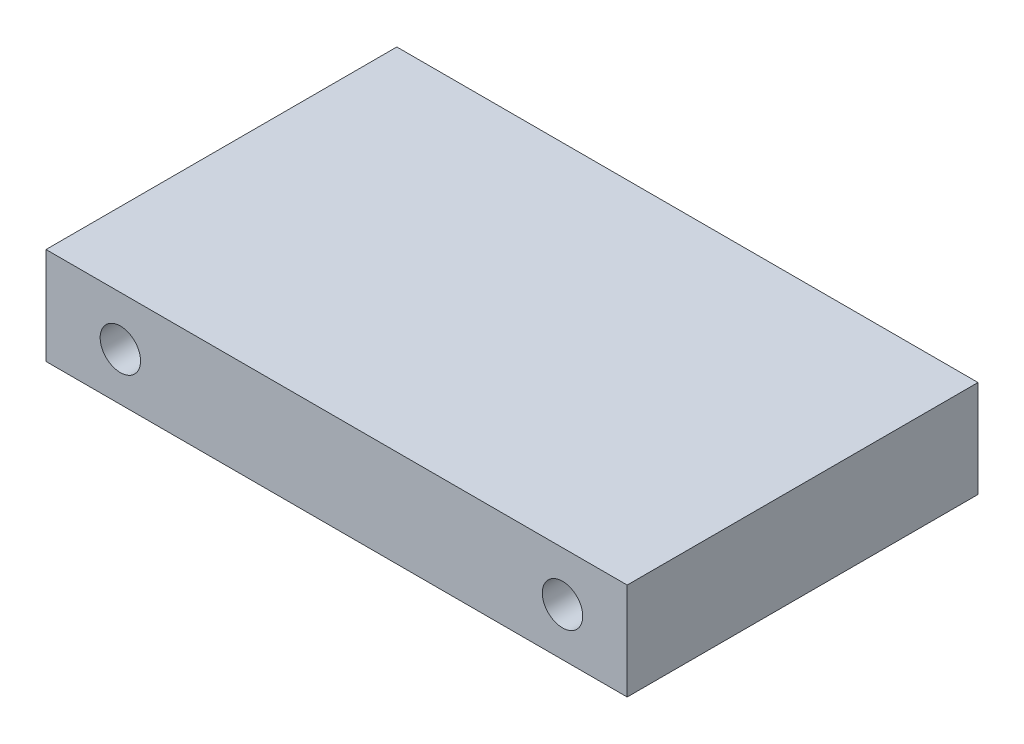
ISO-10303-21;
HEADER;
FILE_DESCRIPTION(('STEP AP214'),'2;1');
FILE_NAME('part.step','',(''),(''),'','','');
FILE_SCHEMA(('AUTOMOTIVE_DESIGN { 1 0 10303 214 1 1 1 1 }'));
ENDSEC;
DATA;
#1=APPLICATION_CONTEXT('core data for automotive mechanical design processes');
#2=APPLICATION_PROTOCOL_DEFINITION('international standard','automotive_design',2000,#1);
#3=PRODUCT_CONTEXT('',#1,'mechanical');
#4=PRODUCT('Part','Part','',(#3));
#5=PRODUCT_RELATED_PRODUCT_CATEGORY('part','',(#4));
#6=PRODUCT_DEFINITION_FORMATION('','',#4);
#7=PRODUCT_DEFINITION_CONTEXT('part definition',#1,'design');
#8=PRODUCT_DEFINITION('design','',#6,#7);
#9=PRODUCT_DEFINITION_SHAPE('','',#8);
#10=(LENGTH_UNIT() NAMED_UNIT(*) SI_UNIT(.MILLI.,.METRE.));
#11=(NAMED_UNIT(*) PLANE_ANGLE_UNIT() SI_UNIT($,.RADIAN.));
#12=(NAMED_UNIT(*) SI_UNIT($,.STERADIAN.) SOLID_ANGLE_UNIT());
#13=UNCERTAINTY_MEASURE_WITH_UNIT(LENGTH_MEASURE(1.E-05),#10,'distance_accuracy_value','');
#14=(GEOMETRIC_REPRESENTATION_CONTEXT(3) GLOBAL_UNCERTAINTY_ASSIGNED_CONTEXT((#13)) GLOBAL_UNIT_ASSIGNED_CONTEXT((#10,
#11,#12)) REPRESENTATION_CONTEXT('',''));
#15=CARTESIAN_POINT('',(0.,0.,0.));
#16=DIRECTION('',(0.,0.,1.));
#17=DIRECTION('',(1.,0.,0.));
#18=AXIS2_PLACEMENT_3D('',#15,#16,#17);
#19=CARTESIAN_POINT('',(-12.6000000000001,570.,10.85));
#20=DIRECTION('',(1.,0.,0.));
#21=DIRECTION('',(0.,0.,-1.));
#22=AXIS2_PLACEMENT_3D('',#19,#20,#21);
#23=PLANE('',#22);
#24=DIRECTION('',(0.,0.,-1.));
#25=VECTOR('',#24,1.);
#26=CARTESIAN_POINT('',(-12.6000000000001,570.,10.85));
#27=LINE('',#26,#25);
#28=CARTESIAN_POINT('',(-12.6000000000001,570.,10.85));
#29=VERTEX_POINT('',#28);
#30=CARTESIAN_POINT('',(-12.6000000000001,570.,-10.85));
#31=VERTEX_POINT('',#30);
#32=EDGE_CURVE('E62',#29,#31,#27,.T.);
#33=ORIENTED_EDGE('',*,*,#32,.T.);
#34=DIRECTION('',(0.,-1.,0.));
#35=VECTOR('',#34,1.);
#36=CARTESIAN_POINT('',(-12.6000000000001,570.,-10.85));
#37=LINE('',#36,#35);
#38=CARTESIAN_POINT('',(-12.6000000000001,564.,-10.85));
#39=VERTEX_POINT('',#38);
#40=EDGE_CURVE('E102',#31,#39,#37,.T.);
#41=ORIENTED_EDGE('',*,*,#40,.T.);
#42=DIRECTION('',(0.,0.,-1.));
#43=VECTOR('',#42,1.);
#44=CARTESIAN_POINT('',(-12.6000000000001,564.,10.85));
#45=LINE('',#44,#43);
#46=CARTESIAN_POINT('',(-12.6000000000001,564.,10.85));
#47=VERTEX_POINT('',#46);
#48=EDGE_CURVE('E11',#47,#39,#45,.T.);
#49=ORIENTED_EDGE('',*,*,#48,.F.);
#50=DIRECTION('',(0.,-1.,0.));
#51=VECTOR('',#50,1.);
#52=CARTESIAN_POINT('',(-12.6000000000001,570.,10.85));
#53=LINE('',#52,#51);
#54=EDGE_CURVE('E122',#29,#47,#53,.T.);
#55=ORIENTED_EDGE('',*,*,#54,.F.);
#56=EDGE_LOOP('',(#33,#41,#49,#55));
#57=FACE_BOUND('',#56,.T.);
#58=ADVANCED_FACE('F47',(#57),#23,.F.);
#59=CARTESIAN_POINT('',(-12.6000000000001,564.,10.85));
#60=DIRECTION('',(0.,1.,0.));
#61=DIRECTION('',(0.,0.,1.));
#62=AXIS2_PLACEMENT_3D('',#59,#60,#61);
#63=PLANE('',#62);
#64=ORIENTED_EDGE('',*,*,#48,.T.);
#65=DIRECTION('',(1.,0.,0.));
#66=VECTOR('',#65,1.);
#67=CARTESIAN_POINT('',(-12.6000000000001,564.,-10.85));
#68=LINE('',#67,#66);
#69=CARTESIAN_POINT('',(23.35,564.,-10.85));
#70=VERTEX_POINT('',#69);
#71=EDGE_CURVE('E92',#39,#70,#68,.T.);
#72=ORIENTED_EDGE('',*,*,#71,.T.);
#73=DIRECTION('',(0.,0.,-1.));
#74=VECTOR('',#73,1.);
#75=CARTESIAN_POINT('',(23.35,564.,10.85));
#76=LINE('',#75,#74);
#77=CARTESIAN_POINT('',(23.35,564.,10.85));
#78=VERTEX_POINT('',#77);
#79=EDGE_CURVE('E55',#78,#70,#76,.T.);
#80=ORIENTED_EDGE('',*,*,#79,.F.);
#81=DIRECTION('',(1.,0.,0.));
#82=VECTOR('',#81,1.);
#83=CARTESIAN_POINT('',(-12.6000000000001,564.,10.85));
#84=LINE('',#83,#82);
#85=EDGE_CURVE('E93',#47,#78,#84,.T.);
#86=ORIENTED_EDGE('',*,*,#85,.F.);
#87=EDGE_LOOP('',(#64,#72,#80,#86));
#88=FACE_BOUND('',#87,.T.);
#89=ADVANCED_FACE('F90',(#88),#63,.F.);
#90=CARTESIAN_POINT('',(23.35,570.,10.85));
#91=DIRECTION('',(1.,0.,0.));
#92=DIRECTION('',(0.,1.,0.));
#93=AXIS2_PLACEMENT_3D('',#90,#91,#92);
#94=PLANE('',#93);
#95=ORIENTED_EDGE('',*,*,#79,.T.);
#96=DIRECTION('',(0.,-1.,0.));
#97=VECTOR('',#96,1.);
#98=CARTESIAN_POINT('',(23.35,570.,-10.85));
#99=LINE('',#98,#97);
#100=CARTESIAN_POINT('',(23.35,570.,-10.85));
#101=VERTEX_POINT('',#100);
#102=EDGE_CURVE('E103',#101,#70,#99,.T.);
#103=ORIENTED_EDGE('',*,*,#102,.F.);
#104=DIRECTION('',(0.,0.,-1.));
#105=VECTOR('',#104,1.);
#106=CARTESIAN_POINT('',(23.35,570.,10.85));
#107=LINE('',#106,#105);
#108=CARTESIAN_POINT('',(23.35,570.,10.85));
#109=VERTEX_POINT('',#108);
#110=EDGE_CURVE('E70',#109,#101,#107,.T.);
#111=ORIENTED_EDGE('',*,*,#110,.F.);
#112=DIRECTION('',(0.,-1.,0.));
#113=VECTOR('',#112,1.);
#114=CARTESIAN_POINT('',(23.35,570.,10.85));
#115=LINE('',#114,#113);
#116=EDGE_CURVE('E127',#109,#78,#115,.T.);
#117=ORIENTED_EDGE('',*,*,#116,.T.);
#118=EDGE_LOOP('',(#95,#103,#111,#117));
#119=FACE_BOUND('',#118,.T.);
#120=ADVANCED_FACE('F137',(#119),#94,.T.);
#121=CARTESIAN_POINT('',(-12.6000000000001,570.,10.85));
#122=DIRECTION('',(0.,1.,0.));
#123=DIRECTION('',(0.,0.,1.));
#124=AXIS2_PLACEMENT_3D('',#121,#122,#123);
#125=PLANE('',#124);
#126=ORIENTED_EDGE('',*,*,#110,.T.);
#127=DIRECTION('',(1.,0.,0.));
#128=VECTOR('',#127,1.);
#129=CARTESIAN_POINT('',(-12.6000000000001,570.,-10.85));
#130=LINE('',#129,#128);
#131=EDGE_CURVE('E119',#31,#101,#130,.T.);
#132=ORIENTED_EDGE('',*,*,#131,.F.);
#133=ORIENTED_EDGE('',*,*,#32,.F.);
#134=DIRECTION('',(1.,0.,0.));
#135=VECTOR('',#134,1.);
#136=CARTESIAN_POINT('',(-12.6000000000001,570.,10.85));
#137=LINE('',#136,#135);
#138=EDGE_CURVE('E130',#29,#109,#137,.T.);
#139=ORIENTED_EDGE('',*,*,#138,.T.);
#140=EDGE_LOOP('',(#126,#132,#133,#139));
#141=FACE_BOUND('',#140,.T.);
#142=ADVANCED_FACE('F141',(#141),#125,.T.);
#143=CARTESIAN_POINT('',(0.,0.,10.85));
#144=DIRECTION('',(0.,0.,1.));
#145=DIRECTION('',(1.,0.,0.));
#146=AXIS2_PLACEMENT_3D('',#143,#144,#145);
#147=PLANE('',#146);
#148=CARTESIAN_POINT('',(-8.,566.953897676285,10.85));
#149=DIRECTION('',(0.,0.,1.));
#150=DIRECTION('',(1.,0.,0.));
#151=AXIS2_PLACEMENT_3D('',#148,#149,#150);
#152=CIRCLE('',#151,1.24999999999998);
#153=CARTESIAN_POINT('',(-6.75000000000002,566.953897676285,10.85));
#154=VERTEX_POINT('',#153);
#155=EDGE_CURVE('E111',#154,#154,#152,.T.);
#156=ORIENTED_EDGE('',*,*,#155,.F.);
#157=EDGE_LOOP('',(#156));
#158=FACE_BOUND('',#157,.T.);
#159=CARTESIAN_POINT('',(19.35,566.953897676285,10.85));
#160=DIRECTION('',(0.,0.,1.));
#161=DIRECTION('',(1.,0.,0.));
#162=AXIS2_PLACEMENT_3D('',#159,#160,#161);
#163=CIRCLE('',#162,1.24999999999996);
#164=CARTESIAN_POINT('',(20.6,566.953897676285,10.85));
#165=VERTEX_POINT('',#164);
#166=EDGE_CURVE('E114',#165,#165,#163,.T.);
#167=ORIENTED_EDGE('',*,*,#166,.F.);
#168=EDGE_LOOP('',(#167));
#169=FACE_BOUND('',#168,.T.);
#170=ORIENTED_EDGE('',*,*,#54,.T.);
#171=ORIENTED_EDGE('',*,*,#85,.T.);
#172=ORIENTED_EDGE('',*,*,#116,.F.);
#173=ORIENTED_EDGE('',*,*,#138,.F.);
#174=EDGE_LOOP('',(#170,#171,#172,#173));
#175=FACE_BOUND('',#174,.T.);
#176=ADVANCED_FACE('F140',(#158,#169,#175),#147,.T.);
#177=CARTESIAN_POINT('',(0.,0.,-10.85));
#178=DIRECTION('',(0.,0.,1.));
#179=DIRECTION('',(1.,0.,0.));
#180=AXIS2_PLACEMENT_3D('',#177,#178,#179);
#181=PLANE('',#180);
#182=CARTESIAN_POINT('',(-8.,566.953897676285,-10.85));
#183=DIRECTION('',(0.,0.,1.));
#184=DIRECTION('',(1.,0.,0.));
#185=AXIS2_PLACEMENT_3D('',#182,#183,#184);
#186=CIRCLE('',#185,1.24999999999998);
#187=CARTESIAN_POINT('',(-6.75000000000002,566.953897676285,-10.85));
#188=VERTEX_POINT('',#187);
#189=EDGE_CURVE('E107',#188,#188,#186,.T.);
#190=ORIENTED_EDGE('',*,*,#189,.T.);
#191=EDGE_LOOP('',(#190));
#192=FACE_BOUND('',#191,.T.);
#193=CARTESIAN_POINT('',(19.35,566.953897676285,-10.85));
#194=DIRECTION('',(0.,0.,1.));
#195=DIRECTION('',(1.,0.,0.));
#196=AXIS2_PLACEMENT_3D('',#193,#194,#195);
#197=CIRCLE('',#196,1.24999999999996);
#198=CARTESIAN_POINT('',(20.6,566.953897676285,-10.85));
#199=VERTEX_POINT('',#198);
#200=EDGE_CURVE('E213',#199,#199,#197,.T.);
#201=ORIENTED_EDGE('',*,*,#200,.T.);
#202=EDGE_LOOP('',(#201));
#203=FACE_BOUND('',#202,.T.);
#204=ORIENTED_EDGE('',*,*,#40,.F.);
#205=ORIENTED_EDGE('',*,*,#131,.T.);
#206=ORIENTED_EDGE('',*,*,#102,.T.);
#207=ORIENTED_EDGE('',*,*,#71,.F.);
#208=EDGE_LOOP('',(#204,#205,#206,#207));
#209=FACE_BOUND('',#208,.T.);
#210=ADVANCED_FACE('F100',(#192,#203,#209),#181,.F.);
#211=CARTESIAN_POINT('',(19.35,566.953897676285,-10.85));
#212=DIRECTION('',(0.,0.,1.));
#213=DIRECTION('',(1.,0.,0.));
#214=AXIS2_PLACEMENT_3D('',#211,#212,#213);
#215=CYLINDRICAL_SURFACE('',#214,1.24999999999996);
#216=ORIENTED_EDGE('',*,*,#200,.F.);
#217=EDGE_LOOP('',(#216));
#218=FACE_BOUND('',#217,.T.);
#219=ORIENTED_EDGE('',*,*,#166,.T.);
#220=EDGE_LOOP('',(#219));
#221=FACE_BOUND('',#220,.T.);
#222=ADVANCED_FACE('F182',(#218,#221),#215,.F.);
#223=CARTESIAN_POINT('',(-8.,566.953897676285,-10.85));
#224=DIRECTION('',(0.,0.,1.));
#225=DIRECTION('',(1.,0.,0.));
#226=AXIS2_PLACEMENT_3D('',#223,#224,#225);
#227=CYLINDRICAL_SURFACE('',#226,1.24999999999998);
#228=ORIENTED_EDGE('',*,*,#189,.F.);
#229=EDGE_LOOP('',(#228));
#230=FACE_BOUND('',#229,.T.);
#231=ORIENTED_EDGE('',*,*,#155,.T.);
#232=EDGE_LOOP('',(#231));
#233=FACE_BOUND('',#232,.T.);
#234=ADVANCED_FACE('F192',(#230,#233),#227,.F.);
#235=CLOSED_SHELL('',(#58,#89,#120,#142,#176,#210,#222,#234));
#236=MANIFOLD_SOLID_BREP('B2',#235);
#237=ADVANCED_BREP_SHAPE_REPRESENTATION('',(#18,#236),#14);
#238=SHAPE_DEFINITION_REPRESENTATION(#9,#237);
ENDSEC;
END-ISO-10303-21;
